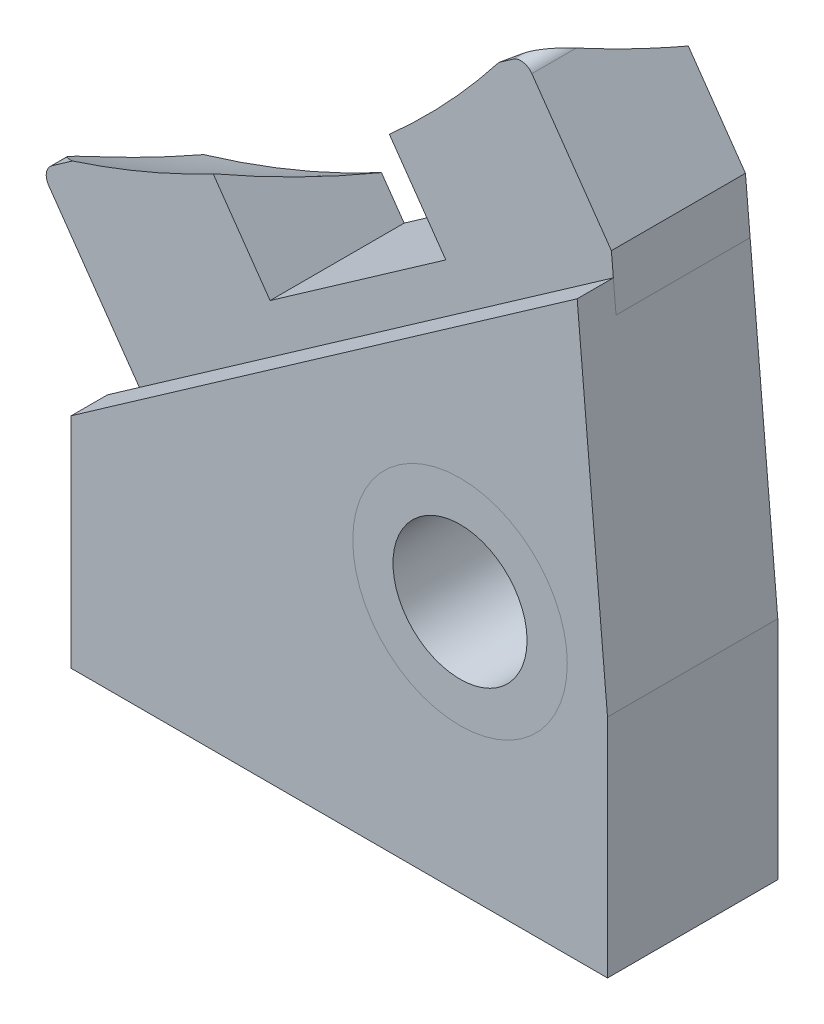
ISO-10303-21;
HEADER;
FILE_DESCRIPTION(('STEP AP214'),'2;1');
FILE_NAME('part.step','',(''),(''),'','','');
FILE_SCHEMA(('AUTOMOTIVE_DESIGN { 1 0 10303 214 1 1 1 1 }'));
ENDSEC;
DATA;
#1=APPLICATION_CONTEXT('core data for automotive mechanical design processes');
#2=APPLICATION_PROTOCOL_DEFINITION('international standard','automotive_design',2000,#1);
#3=PRODUCT_CONTEXT('',#1,'mechanical');
#4=PRODUCT('Part','Part','',(#3));
#5=PRODUCT_RELATED_PRODUCT_CATEGORY('part','',(#4));
#6=PRODUCT_DEFINITION_FORMATION('','',#4);
#7=PRODUCT_DEFINITION_CONTEXT('part definition',#1,'design');
#8=PRODUCT_DEFINITION('design','',#6,#7);
#9=PRODUCT_DEFINITION_SHAPE('','',#8);
#10=(LENGTH_UNIT() NAMED_UNIT(*) SI_UNIT(.MILLI.,.METRE.));
#11=(NAMED_UNIT(*) PLANE_ANGLE_UNIT() SI_UNIT($,.RADIAN.));
#12=(NAMED_UNIT(*) SI_UNIT($,.STERADIAN.) SOLID_ANGLE_UNIT());
#13=UNCERTAINTY_MEASURE_WITH_UNIT(LENGTH_MEASURE(1.E-05),#10,'distance_accuracy_value','');
#14=(GEOMETRIC_REPRESENTATION_CONTEXT(3) GLOBAL_UNCERTAINTY_ASSIGNED_CONTEXT((#13)) GLOBAL_UNIT_ASSIGNED_CONTEXT((#10,
#11,#12)) REPRESENTATION_CONTEXT('',''));
#15=CARTESIAN_POINT('',(0.,0.,0.));
#16=DIRECTION('',(0.,0.,1.));
#17=DIRECTION('',(1.,0.,0.));
#18=AXIS2_PLACEMENT_3D('',#15,#16,#17);
#19=CARTESIAN_POINT('',(14.5,9.4,0.));
#20=DIRECTION('',(0.,0.,1.));
#21=DIRECTION('',(1.,0.,0.));
#22=AXIS2_PLACEMENT_3D('',#19,#20,#21);
#23=CYLINDRICAL_SURFACE('',#22,4.);
#24=CARTESIAN_POINT('',(14.5,9.4,0.));
#25=DIRECTION('',(0.,0.,1.));
#26=DIRECTION('',(1.,0.,0.));
#27=AXIS2_PLACEMENT_3D('',#24,#25,#26);
#28=CIRCLE('',#27,4.);
#29=CARTESIAN_POINT('',(18.5,9.4,0.));
#30=VERTEX_POINT('',#29);
#31=EDGE_CURVE('E11',#30,#30,#28,.T.);
#32=ORIENTED_EDGE('',*,*,#31,.T.);
#33=EDGE_LOOP('',(#32));
#34=FACE_BOUND('',#33,.T.);
#35=CARTESIAN_POINT('',(14.5,9.4,6.35));
#36=DIRECTION('',(0.,0.,1.));
#37=DIRECTION('',(1.,0.,0.));
#38=AXIS2_PLACEMENT_3D('',#35,#36,#37);
#39=CIRCLE('',#38,4.);
#40=CARTESIAN_POINT('',(18.5,9.4,6.35));
#41=VERTEX_POINT('',#40);
#42=EDGE_CURVE('E47',#41,#41,#39,.T.);
#43=ORIENTED_EDGE('',*,*,#42,.F.);
#44=EDGE_LOOP('',(#43));
#45=FACE_BOUND('',#44,.T.);
#46=ADVANCED_FACE('F44',(#34,#45),#23,.T.);
#47=CARTESIAN_POINT('',(14.5,9.4,0.));
#48=DIRECTION('',(0.,0.,1.));
#49=DIRECTION('',(1.,0.,0.));
#50=AXIS2_PLACEMENT_3D('',#47,#48,#49);
#51=PLANE('',#50);
#52=CARTESIAN_POINT('',(14.5,9.4,0.));
#53=DIRECTION('',(0.,0.,1.));
#54=DIRECTION('',(1.,0.,0.));
#55=AXIS2_PLACEMENT_3D('',#52,#53,#54);
#56=CIRCLE('',#55,2.5);
#57=CARTESIAN_POINT('',(17.,9.4,0.));
#58=VERTEX_POINT('',#57);
#59=EDGE_CURVE('E54',#58,#58,#56,.T.);
#60=ORIENTED_EDGE('',*,*,#59,.T.);
#61=EDGE_LOOP('',(#60));
#62=FACE_BOUND('',#61,.T.);
#63=ORIENTED_EDGE('',*,*,#31,.F.);
#64=EDGE_LOOP('',(#63));
#65=FACE_BOUND('',#64,.T.);
#66=ADVANCED_FACE('F62',(#62,#65),#51,.F.);
#67=CARTESIAN_POINT('',(14.5,9.4,6.35));
#68=DIRECTION('',(0.,0.,1.));
#69=DIRECTION('',(1.,0.,0.));
#70=AXIS2_PLACEMENT_3D('',#67,#68,#69);
#71=PLANE('',#70);
#72=CARTESIAN_POINT('',(14.5,9.4,6.35));
#73=DIRECTION('',(0.,0.,1.));
#74=DIRECTION('',(1.,0.,0.));
#75=AXIS2_PLACEMENT_3D('',#72,#73,#74);
#76=CIRCLE('',#75,2.5);
#77=CARTESIAN_POINT('',(17.,9.4,6.35));
#78=VERTEX_POINT('',#77);
#79=EDGE_CURVE('E56',#78,#78,#76,.T.);
#80=ORIENTED_EDGE('',*,*,#79,.F.);
#81=EDGE_LOOP('',(#80));
#82=FACE_BOUND('',#81,.T.);
#83=ORIENTED_EDGE('',*,*,#42,.T.);
#84=EDGE_LOOP('',(#83));
#85=FACE_BOUND('',#84,.T.);
#86=ADVANCED_FACE('F68',(#82,#85),#71,.T.);
#87=CARTESIAN_POINT('',(14.5,9.4,0.));
#88=DIRECTION('',(0.,0.,1.));
#89=DIRECTION('',(1.,0.,0.));
#90=AXIS2_PLACEMENT_3D('',#87,#88,#89);
#91=CYLINDRICAL_SURFACE('',#90,2.5);
#92=ORIENTED_EDGE('',*,*,#59,.F.);
#93=EDGE_LOOP('',(#92));
#94=FACE_BOUND('',#93,.T.);
#95=ORIENTED_EDGE('',*,*,#79,.T.);
#96=EDGE_LOOP('',(#95));
#97=FACE_BOUND('',#96,.T.);
#98=ADVANCED_FACE('F65',(#94,#97),#91,.F.);
#99=CLOSED_SHELL('',(#46,#66,#86,#98));
#100=MANIFOLD_SOLID_BREP('B2',#99);
#101=CARTESIAN_POINT('',(1.76621588567381,8.17458828241091,0.));
#102=DIRECTION('',(-0.573576436351047,0.819152044288991,0.));
#103=DIRECTION('',(-0.819152044288991,-0.573576436351047,0.));
#104=AXIS2_PLACEMENT_3D('',#101,#102,#103);
#105=PLANE('',#104);
#106=DIRECTION('',(-0.819152044288991,-0.573576436351047,0.));
#107=VECTOR('',#106,1.);
#108=CARTESIAN_POINT('',(1.76621588567381,8.17458828241091,5.));
#109=LINE('',#108,#107);
#110=CARTESIAN_POINT('',(18.9684088157426,20.2196934457829,5.));
#111=VERTEX_POINT('',#110);
#112=CARTESIAN_POINT('',(1.76621588567381,8.17458828241091,5.));
#113=VERTEX_POINT('',#112);
#114=EDGE_CURVE('E273',#111,#113,#109,.T.);
#115=ORIENTED_EDGE('',*,*,#114,.T.);
#116=DIRECTION('',(0.,0.,1.));
#117=VECTOR('',#116,1.);
#118=CARTESIAN_POINT('',(1.76621588567381,8.17458828241091,0.));
#119=LINE('',#118,#117);
#120=CARTESIAN_POINT('',(1.76621588567381,8.17458828241091,0.));
#121=VERTEX_POINT('',#120);
#122=EDGE_CURVE('E213',#121,#113,#119,.T.);
#123=ORIENTED_EDGE('',*,*,#122,.F.);
#124=DIRECTION('',(-0.819152044288991,-0.573576436351047,0.));
#125=VECTOR('',#124,1.);
#126=CARTESIAN_POINT('',(1.76621588567381,8.17458828241091,0.));
#127=LINE('',#126,#125);
#128=CARTESIAN_POINT('',(18.9684088157426,20.2196934457829,0.));
#129=VERTEX_POINT('',#128);
#130=EDGE_CURVE('E237',#129,#121,#127,.T.);
#131=ORIENTED_EDGE('',*,*,#130,.F.);
#132=DIRECTION('',(0.,0.,1.));
#133=VECTOR('',#132,1.);
#134=CARTESIAN_POINT('',(18.9684088157426,20.2196934457829,0.));
#135=LINE('',#134,#133);
#136=EDGE_CURVE('E238',#129,#111,#135,.T.);
#137=ORIENTED_EDGE('',*,*,#136,.T.);
#138=EDGE_LOOP('',(#115,#123,#131,#137));
#139=FACE_BOUND('',#138,.T.);
#140=ADVANCED_FACE('F115',(#139),#105,.F.);
#141=CARTESIAN_POINT('',(-2.19146152514842,13.8267373880049,0.));
#142=DIRECTION('',(0.81915204428899,0.573576436351049,0.));
#143=DIRECTION('',(-0.573576436351049,0.81915204428899,0.));
#144=AXIS2_PLACEMENT_3D('',#141,#142,#143);
#145=PLANE('',#144);
#146=DIRECTION('',(0.,0.,1.));
#147=VECTOR('',#146,1.);
#148=CARTESIAN_POINT('',(-2.19146152514842,13.8267373880049,0.));
#149=LINE('',#148,#147);
#150=CARTESIAN_POINT('',(-2.19146152514842,13.8267373880049,3.14743885674291));
#151=VERTEX_POINT('',#150);
#152=CARTESIAN_POINT('',(-2.19146152514842,13.8267373880049,5.));
#153=VERTEX_POINT('',#152);
#154=EDGE_CURVE('E256',#151,#153,#149,.T.);
#155=ORIENTED_EDGE('',*,*,#154,.F.);
#156=CARTESIAN_POINT('',(-20.5747439319309,40.0807855146286,-12.575));
#157=DIRECTION('',(0.81915204428899,0.573576436351049,0.));
#158=DIRECTION('',(-0.573576436351049,0.81915204428899,0.));
#159=AXIS2_PLACEMENT_3D('',#156,#157,#158);
#160=CIRCLE('',#159,35.6989523471854);
#161=CARTESIAN_POINT('',(-1.41107043489377,12.7122234079785,0.));
#162=VERTEX_POINT('',#161);
#163=EDGE_CURVE('E281',#151,#162,#160,.T.);
#164=ORIENTED_EDGE('',*,*,#163,.T.);
#165=DIRECTION('',(-0.573576436351049,0.81915204428899,0.));
#166=VECTOR('',#165,1.);
#167=CARTESIAN_POINT('',(-2.19146152514842,13.8267373880049,0.));
#168=LINE('',#167,#166);
#169=EDGE_CURVE('E268',#121,#162,#168,.T.);
#170=ORIENTED_EDGE('',*,*,#169,.F.);
#171=ORIENTED_EDGE('',*,*,#122,.T.);
#172=DIRECTION('',(-0.573576436351049,0.81915204428899,0.));
#173=VECTOR('',#172,1.);
#174=CARTESIAN_POINT('',(-2.19146152514842,13.8267373880049,5.));
#175=LINE('',#174,#173);
#176=EDGE_CURVE('E264',#113,#153,#175,.T.);
#177=ORIENTED_EDGE('',*,*,#176,.T.);
#178=EDGE_LOOP('',(#155,#164,#170,#171,#177));
#179=FACE_BOUND('',#178,.T.);
#180=ADVANCED_FACE('F263',(#179),#145,.F.);
#181=CARTESIAN_POINT('',(-1.78188550300392,14.1135256061805,0.));
#182=DIRECTION('',(0.,0.,1.));
#183=DIRECTION('',(1.,0.,0.));
#184=AXIS2_PLACEMENT_3D('',#181,#182,#183);
#185=CYLINDRICAL_SURFACE('',#184,0.500000000000004);
#186=DIRECTION('',(0.,0.,1.));
#187=VECTOR('',#186,1.);
#188=CARTESIAN_POINT('',(-2.06867372117944,14.523101628325,0.));
#189=LINE('',#188,#187);
#190=CARTESIAN_POINT('',(-2.06867372117944,14.523101628325,4.45099817720472));
#191=VERTEX_POINT('',#190);
#192=CARTESIAN_POINT('',(-2.06867372117944,14.523101628325,5.));
#193=VERTEX_POINT('',#192);
#194=EDGE_CURVE('E254',#191,#193,#189,.T.);
#195=ORIENTED_EDGE('',*,*,#194,.F.);
#196=CARTESIAN_POINT('',(-2.00502989377036,14.5609701065037,4.48678663558968));
#197=CARTESIAN_POINT('',(-2.01672846327894,14.5551369022201,4.48235337617569));
#198=CARTESIAN_POINT('',(-2.02788071069159,14.5490025537958,4.47703776370984));
#199=CARTESIAN_POINT('',(-2.04900856626487,14.5363665900562,4.46503565451942));
#200=CARTESIAN_POINT('',(-2.05899528559048,14.5298694999821,4.45836411608942));
#201=CARTESIAN_POINT('',(-2.09129369058268,14.5072844763242,4.43378359838701));
#202=CARTESIAN_POINT('',(-2.11116745470781,14.490569114837,4.41327511997102));
#203=CARTESIAN_POINT('',(-2.14636894878509,14.456683243962,4.36871052390673));
#204=CARTESIAN_POINT('',(-2.16163721425105,14.4395096605899,4.34461354607604));
#205=CARTESIAN_POINT('',(-2.18661951146774,14.4076968255793,4.29798198369882));
#206=CARTESIAN_POINT('',(-2.19681364321337,14.3930425957066,4.27570828960097));
#207=CARTESIAN_POINT('',(-2.2150132656029,14.3639153884213,4.23015928721368));
#208=CARTESIAN_POINT('',(-2.22301673995691,14.3494425896089,4.20688307885433));
#209=CARTESIAN_POINT('',(-2.24427645296267,14.306452598763,4.13614366362497));
#210=CARTESIAN_POINT('',(-2.25483610305505,14.2782889068655,4.08765727964852));
#211=CARTESIAN_POINT('',(-2.27085631977183,14.2220897091891,3.98752700137146));
#212=CARTESIAN_POINT('',(-2.27612084574242,14.1940948734619,3.93583220813581));
#213=CARTESIAN_POINT('',(-2.28198183394443,14.1392790770529,3.83151158250489));
#214=CARTESIAN_POINT('',(-2.28257343832751,14.1124593667872,3.77888483820524));
#215=CARTESIAN_POINT('',(-2.27970739659492,14.060019683803,3.67309569820534));
#216=CARTESIAN_POINT('',(-2.27624567802049,14.0344009446411,3.61993281707883));
#217=CARTESIAN_POINT('',(-2.26560655063931,13.9844265373175,3.51338513964409));
#218=CARTESIAN_POINT('',(-2.25842898262819,13.9600709233233,3.46000033392479));
#219=CARTESIAN_POINT('',(-2.24215541447755,13.9171186273275,3.36319424965613));
#220=CARTESIAN_POINT('',(-2.23366631921648,13.8982946608966,3.31977045995281));
#221=CARTESIAN_POINT('',(-2.21430652482225,13.8616515185404,3.23316515846273));
#222=CARTESIAN_POINT('',(-2.2034420870907,13.8438298529816,3.18998331021881));
#223=CARTESIAN_POINT('',(-2.17887631794179,13.8087820805661,3.10274682686394));
#224=CARTESIAN_POINT('',(-2.16510683871342,13.791584681523,3.05869976638875));
#225=CARTESIAN_POINT('',(-2.13466902570549,13.7584902778389,2.97113689591945));
#226=CARTESIAN_POINT('',(-2.11800248560398,13.7425924774703,2.92762077493771));
#227=CARTESIAN_POINT('',(-2.09038569659118,13.7198619395452,2.86277535180127));
#228=CARTESIAN_POINT('',(-2.0806857558358,13.7124349744962,2.84111865999403));
#229=CARTESIAN_POINT('',(-2.06033634146403,13.6980495361927,2.79810342801912));
#230=CARTESIAN_POINT('',(-2.0496871416814,13.6910909288407,2.77674480391056));
#231=CARTESIAN_POINT('',(-2.02729390187541,13.6776972329481,2.734354074589));
#232=CARTESIAN_POINT('',(-2.01554693370292,13.6712636355557,2.71332302791638));
#233=CARTESIAN_POINT('',(-1.99080209229597,13.6590575783331,2.6717854778283));
#234=CARTESIAN_POINT('',(-1.97780300139244,13.6532857742779,2.65127951007535));
#235=CARTESIAN_POINT('',(-1.9640986741615,13.647909497936,2.63112584982703));
#236=B_SPLINE_CURVE_WITH_KNOTS('',3,(#196,#197,#198,#199,#200,#201,#202,#203,#204,#205,#206,
#207,#208,#209,#210,#211,#212,#213,#214,#215,#216,#217,#218,#219,#220,#221,#222,#223,#224,#225,
#226,#227,#228,#229,#230,#231,#232,#233,#234,#235),.UNSPECIFIED.,.F.,.F.,(4,2,2,2,2,2,2,2,2,2,2,
2,2,2,2,2,2,2,2,4),(0.,0.0412905066520692,0.082148076769165,0.180515417161114,0.280103251882235,
0.365609009398243,0.45119320412109,0.621929257275343,0.79877648876252,0.97580754188915,
1.15301661456704,1.33023328033844,1.47441965980284,1.61823045061032,1.765890417379,
1.91345928590351,1.98803423396507,2.0625877385045,2.13734611216348,2.21217793557636),.UNSPECIFIED.);
#237=EDGE_CURVE('E317',#191,#151,#236,.T.);
#238=ORIENTED_EDGE('',*,*,#237,.T.);
#239=ORIENTED_EDGE('',*,*,#154,.T.);
#240=CARTESIAN_POINT('',(-1.78188550300392,14.1135256061805,5.));
#241=DIRECTION('',(0.,0.,-1.));
#242=DIRECTION('',(1.,0.,0.));
#243=AXIS2_PLACEMENT_3D('',#240,#241,#242);
#244=CIRCLE('',#243,0.500000000000004);
#245=EDGE_CURVE('E278',#153,#193,#244,.T.);
#246=ORIENTED_EDGE('',*,*,#245,.T.);
#247=EDGE_LOOP('',(#195,#238,#239,#246));
#248=FACE_BOUND('',#247,.T.);
#249=ADVANCED_FACE('F326',(#248),#185,.T.);
#250=CARTESIAN_POINT('',(3.255814566699,18.2513484646068,0.));
#251=DIRECTION('',(0.573576436351047,-0.819152044288991,0.));
#252=DIRECTION('',(0.819152044288991,0.573576436351047,0.));
#253=AXIS2_PLACEMENT_3D('',#250,#251,#252);
#254=PLANE('',#253);
#255=DIRECTION('',(0.819152044288991,0.573576436351047,0.));
#256=VECTOR('',#255,1.);
#257=CARTESIAN_POINT('',(3.255814566699,18.2513484646068,5.));
#258=LINE('',#257,#256);
#259=CARTESIAN_POINT('',(-1.30382888322489,15.0586517494215,5.));
#260=VERTEX_POINT('',#259);
#261=EDGE_CURVE('E289',#193,#260,#258,.T.);
#262=ORIENTED_EDGE('',*,*,#261,.T.);
#263=CARTESIAN_POINT('',(6.64649418860697,20.6255278955208,-12.575));
#264=DIRECTION('',(0.573576436351047,-0.819152044288991,0.));
#265=DIRECTION('',(0.819152044288991,0.573576436351047,0.));
#266=AXIS2_PLACEMENT_3D('',#263,#264,#265);
#267=CIRCLE('',#266,20.076811798005);
#268=EDGE_CURVE('E128',#260,#191,#267,.T.);
#269=ORIENTED_EDGE('',*,*,#268,.T.);
#270=ORIENTED_EDGE('',*,*,#194,.T.);
#271=EDGE_LOOP('',(#262,#269,#270));
#272=FACE_BOUND('',#271,.T.);
#273=ADVANCED_FACE('F361',(#272),#254,.F.);
#274=CARTESIAN_POINT('',(3.255814566699,18.2513484646068,0.));
#275=DIRECTION('',(-0.819152044288991,-0.573576436351047,0.));
#276=DIRECTION('',(0.573576436351047,-0.819152044288991,0.));
#277=AXIS2_PLACEMENT_3D('',#274,#275,#276);
#278=PLANE('',#277);
#279=DIRECTION('',(0.573576436351047,-0.819152044288991,0.));
#280=VECTOR('',#279,1.);
#281=CARTESIAN_POINT('',(3.255814566699,18.2513484646068,0.));
#282=LINE('',#281,#280);
#283=CARTESIAN_POINT('',(5.220021155257,15.4461707403279,0.));
#284=VERTEX_POINT('',#283);
#285=CARTESIAN_POINT('',(6.06633910481913,14.2375034475907,0.));
#286=VERTEX_POINT('',#285);
#287=EDGE_CURVE('E310',#284,#286,#282,.T.);
#288=ORIENTED_EDGE('',*,*,#287,.F.);
#289=CARTESIAN_POINT('',(-14.840679621908,44.095820569086,-12.575));
#290=DIRECTION('',(-0.819152044288991,-0.573576436351047,0.));
#291=DIRECTION('',(0.573576436351047,-0.819152044288991,0.));
#292=AXIS2_PLACEMENT_3D('',#289,#290,#291);
#293=CIRCLE('',#292,37.1667159698218);
#294=CARTESIAN_POINT('',(3.94326256215231,17.2695709801612,5.));
#295=VERTEX_POINT('',#294);
#296=EDGE_CURVE('E343',#284,#295,#293,.T.);
#297=ORIENTED_EDGE('',*,*,#296,.T.);
#298=DIRECTION('',(0.573576436351047,-0.819152044288991,0.));
#299=VECTOR('',#298,1.);
#300=CARTESIAN_POINT('',(3.255814566699,18.2513484646068,5.));
#301=LINE('',#300,#299);
#302=CARTESIAN_POINT('',(6.06633910481913,14.2375034475907,5.));
#303=VERTEX_POINT('',#302);
#304=EDGE_CURVE('E292',#295,#303,#301,.T.);
#305=ORIENTED_EDGE('',*,*,#304,.T.);
#306=DIRECTION('',(0.,0.,1.));
#307=VECTOR('',#306,1.);
#308=CARTESIAN_POINT('',(6.06633910481913,14.2375034475907,0.));
#309=LINE('',#308,#307);
#310=EDGE_CURVE('E251',#286,#303,#309,.T.);
#311=ORIENTED_EDGE('',*,*,#310,.F.);
#312=EDGE_LOOP('',(#288,#297,#305,#311));
#313=FACE_BOUND('',#312,.T.);
#314=ADVANCED_FACE('F359',(#313),#278,.F.);
#315=CARTESIAN_POINT('',(6.06633910481913,14.2375034475907,0.));
#316=DIRECTION('',(0.573576436351047,-0.819152044288991,0.));
#317=DIRECTION('',(0.819152044288991,0.573576436351047,0.));
#318=AXIS2_PLACEMENT_3D('',#315,#316,#317);
#319=PLANE('',#318);
#320=DIRECTION('',(0.819152044288991,0.573576436351047,0.));
#321=VECTOR('',#320,1.);
#322=CARTESIAN_POINT('',(6.06633910481913,14.2375034475907,5.));
#323=LINE('',#322,#321);
#324=CARTESIAN_POINT('',(12.6195554591311,18.8261149383991,5.));
#325=VERTEX_POINT('',#324);
#326=EDGE_CURVE('E230',#303,#325,#323,.T.);
#327=ORIENTED_EDGE('',*,*,#326,.T.);
#328=DIRECTION('',(0.,0.,1.));
#329=VECTOR('',#328,1.);
#330=CARTESIAN_POINT('',(12.6195554591311,18.8261149383991,0.));
#331=LINE('',#330,#329);
#332=CARTESIAN_POINT('',(12.6195554591311,18.8261149383991,0.));
#333=VERTEX_POINT('',#332);
#334=EDGE_CURVE('E248',#333,#325,#331,.T.);
#335=ORIENTED_EDGE('',*,*,#334,.F.);
#336=DIRECTION('',(0.819152044288991,0.573576436351047,0.));
#337=VECTOR('',#336,1.);
#338=CARTESIAN_POINT('',(6.06633910481913,14.2375034475907,0.));
#339=LINE('',#338,#337);
#340=EDGE_CURVE('E308',#286,#333,#339,.T.);
#341=ORIENTED_EDGE('',*,*,#340,.F.);
#342=ORIENTED_EDGE('',*,*,#310,.T.);
#343=EDGE_LOOP('',(#327,#335,#341,#342));
#344=FACE_BOUND('',#343,.T.);
#345=ADVANCED_FACE('F296',(#344),#319,.F.);
#346=CARTESIAN_POINT('',(9.80903092101094,22.8399599554152,0.));
#347=DIRECTION('',(0.819152044288992,0.573576436351046,0.));
#348=DIRECTION('',(-0.573576436351046,0.819152044288992,0.));
#349=AXIS2_PLACEMENT_3D('',#346,#347,#348);
#350=PLANE('',#349);
#351=DIRECTION('',(-0.573576436351046,0.819152044288992,0.));
#352=VECTOR('',#351,1.);
#353=CARTESIAN_POINT('',(9.80903092101094,22.8399599554152,5.));
#354=LINE('',#353,#352);
#355=CARTESIAN_POINT('',(10.5159806349556,21.8303311305782,5.));
#356=VERTEX_POINT('',#355);
#357=EDGE_CURVE('E226',#325,#356,#354,.T.);
#358=ORIENTED_EDGE('',*,*,#357,.T.);
#359=CARTESIAN_POINT('',(-8.28746326759597,48.6844320598944,-12.575));
#360=DIRECTION('',(0.819152044288992,0.573576436351046,0.));
#361=DIRECTION('',(-0.573576436351046,0.819152044288992,0.));
#362=AXIS2_PLACEMENT_3D('',#359,#360,#361);
#363=CIRCLE('',#362,37.1966781355312);
#364=CARTESIAN_POINT('',(11.7914992129017,20.008701815922,0.));
#365=VERTEX_POINT('',#364);
#366=EDGE_CURVE('E136',#356,#365,#363,.T.);
#367=ORIENTED_EDGE('',*,*,#366,.T.);
#368=DIRECTION('',(-0.573576436351046,0.819152044288992,0.));
#369=VECTOR('',#368,1.);
#370=CARTESIAN_POINT('',(9.80903092101094,22.8399599554152,0.));
#371=LINE('',#370,#369);
#372=EDGE_CURVE('E304',#333,#365,#371,.T.);
#373=ORIENTED_EDGE('',*,*,#372,.F.);
#374=ORIENTED_EDGE('',*,*,#334,.T.);
#375=EDGE_LOOP('',(#358,#367,#373,#374));
#376=FACE_BOUND('',#375,.T.);
#377=ADVANCED_FACE('F302',(#376),#350,.F.);
#378=CARTESIAN_POINT('',(15.1335192088894,26.568206791697,0.));
#379=DIRECTION('',(0.573576436351047,-0.819152044288991,0.));
#380=DIRECTION('',(0.819152044288991,0.573576436351047,0.));
#381=AXIS2_PLACEMENT_3D('',#378,#379,#380);
#382=PLANE('',#381);
#383=DIRECTION('',(0.,0.,1.));
#384=VECTOR('',#383,1.);
#385=CARTESIAN_POINT('',(15.1335192088894,26.568206791697,0.));
#386=LINE('',#385,#384);
#387=CARTESIAN_POINT('',(15.1335192088894,26.568206791697,4.62189930814719));
#388=VERTEX_POINT('',#387);
#389=CARTESIAN_POINT('',(15.1335192088894,26.568206791697,5.));
#390=VERTEX_POINT('',#389);
#391=EDGE_CURVE('E220',#388,#390,#386,.T.);
#392=ORIENTED_EDGE('',*,*,#391,.F.);
#393=CARTESIAN_POINT('',(6.64649418860696,20.6255278955208,-12.575));
#394=DIRECTION('',(0.573576436351047,-0.819152044288991,0.));
#395=DIRECTION('',(0.819152044288991,0.573576436351047,0.));
#396=AXIS2_PLACEMENT_3D('',#393,#394,#395);
#397=CIRCLE('',#396,20.076811798005);
#398=CARTESIAN_POINT('',(14.5968172604388,26.19240404162,5.));
#399=VERTEX_POINT('',#398);
#400=EDGE_CURVE('E207',#388,#399,#397,.T.);
#401=ORIENTED_EDGE('',*,*,#400,.T.);
#402=DIRECTION('',(0.819152044288991,0.573576436351047,0.));
#403=VECTOR('',#402,1.);
#404=CARTESIAN_POINT('',(15.1335192088894,26.568206791697,5.));
#405=LINE('',#404,#403);
#406=EDGE_CURVE('E218',#399,#390,#405,.T.);
#407=ORIENTED_EDGE('',*,*,#406,.T.);
#408=EDGE_LOOP('',(#392,#401,#407));
#409=FACE_BOUND('',#408,.T.);
#410=ADVANCED_FACE('F217',(#409),#382,.F.);
#411=CARTESIAN_POINT('',(15.4203074270649,26.1586307695525,0.));
#412=DIRECTION('',(0.,0.,1.));
#413=DIRECTION('',(1.,0.,0.));
#414=AXIS2_PLACEMENT_3D('',#411,#412,#413);
#415=CYLINDRICAL_SURFACE('',#414,0.500000000000004);
#416=DIRECTION('',(0.,0.,1.));
#417=VECTOR('',#416,1.);
#418=CARTESIAN_POINT('',(15.8298834492094,26.445418987728,0.));
#419=LINE('',#418,#417);
#420=CARTESIAN_POINT('',(15.8298834492094,26.445418987728,3.34110274314999));
#421=VERTEX_POINT('',#420);
#422=CARTESIAN_POINT('',(15.8298834492094,26.445418987728,5.));
#423=VERTEX_POINT('',#422);
#424=EDGE_CURVE('E245',#421,#423,#419,.T.);
#425=ORIENTED_EDGE('',*,*,#424,.F.);
#426=CARTESIAN_POINT('',(15.8300234179695,26.445218987728,3.34061120333065));
#427=CARTESIAN_POINT('',(15.820737310627,26.458485317027,3.37321945634485));
#428=CARTESIAN_POINT('',(15.8109101295611,26.471172431617,3.4059014664241));
#429=CARTESIAN_POINT('',(15.7902202544462,26.4954088507666,3.47135929527277));
#430=CARTESIAN_POINT('',(15.7793575748163,26.5069581711651,3.50413511272979));
#431=CARTESIAN_POINT('',(15.7452085963353,26.540005637695,3.60274710363396));
#432=CARTESIAN_POINT('',(15.7204251126557,26.5598133354765,3.66864535713327));
#433=CARTESIAN_POINT('',(15.666750715416,26.5948675653505,3.80073192558767));
#434=CARTESIAN_POINT('',(15.6378238018157,26.6100700404976,3.86691725280711));
#435=CARTESIAN_POINT('',(15.5759124707009,26.6349740133313,3.99833479984366));
#436=CARTESIAN_POINT('',(15.5429353783005,26.6446852691284,4.06356850840494));
#437=CARTESIAN_POINT('',(15.4836375117419,26.65520142319,4.17175083140276));
#438=CARTESIAN_POINT('',(15.4585365810198,26.6578568407398,4.21518702821803));
#439=CARTESIAN_POINT('',(15.4059008479247,26.6591209035427,4.30073378596808));
#440=CARTESIAN_POINT('',(15.3783645012612,26.6577269630118,4.3428434824906));
#441=CARTESIAN_POINT('',(15.3286664974992,26.6506069851645,4.41306044304535));
#442=CARTESIAN_POINT('',(15.3071760418763,26.6462119698995,4.44177047864069));
#443=CARTESIAN_POINT('',(15.2627063398303,26.6337041881675,4.49697072474863));
#444=CARTESIAN_POINT('',(15.2397372475824,26.6256148502799,4.52347369801733));
#445=CARTESIAN_POINT('',(15.2026921751986,26.6090243756713,4.56192682204405));
#446=CARTESIAN_POINT('',(15.1891651013015,26.6022805317895,4.57513755673285));
#447=CARTESIAN_POINT('',(15.1615880876323,26.5867811584544,4.59997041611349));
#448=CARTESIAN_POINT('',(15.1475347412782,26.578009405029,4.61157845328144));
#449=CARTESIAN_POINT('',(15.1333192088894,26.5680666773921,4.62204631937596));
#450=B_SPLINE_CURVE_WITH_KNOTS('',3,(#426,#427,#428,#429,#430,#431,#432,#433,#434,#435,#436,
#437,#438,#439,#440,#441,#442,#443,#444,#445,#446,#447,#448,#449),.UNSPECIFIED.,.F.,.F.,(4,2,2,
2,2,2,2,2,2,2,2,4),(0.,0.109201888111957,0.218402255842343,0.437545561198591,0.658723562172715,
0.879507275953485,1.03005437128678,1.18069762207095,1.28890306804247,1.39643162898834,
1.45650495506648,1.51707662303462),.UNSPECIFIED.);
#451=EDGE_CURVE('E337',#421,#388,#450,.T.);
#452=ORIENTED_EDGE('',*,*,#451,.T.);
#453=ORIENTED_EDGE('',*,*,#391,.T.);
#454=CARTESIAN_POINT('',(15.4203074270649,26.1586307695525,5.));
#455=DIRECTION('',(0.,0.,-1.));
#456=DIRECTION('',(1.,0.,0.));
#457=AXIS2_PLACEMENT_3D('',#454,#455,#456);
#458=CIRCLE('',#457,0.500000000000004);
#459=EDGE_CURVE('E225',#390,#423,#458,.T.);
#460=ORIENTED_EDGE('',*,*,#459,.T.);
#461=EDGE_LOOP('',(#425,#452,#453,#460));
#462=FACE_BOUND('',#461,.T.);
#463=ADVANCED_FACE('F345',(#462),#415,.T.);
#464=CARTESIAN_POINT('',(18.7940973302473,22.2120828419664,0.));
#465=DIRECTION('',(-0.819152044288992,-0.573576436351046,0.));
#466=DIRECTION('',(0.573576436351046,-0.819152044288992,0.));
#467=AXIS2_PLACEMENT_3D('',#464,#465,#466);
#468=PLANE('',#467);
#469=DIRECTION('',(0.573576436351046,-0.819152044288992,0.));
#470=VECTOR('',#469,1.);
#471=CARTESIAN_POINT('',(18.7940973302473,22.2120828419664,0.));
#472=LINE('',#471,#470);
#473=CARTESIAN_POINT('',(16.6627968967664,25.2558953078108,0.));
#474=VERTEX_POINT('',#473);
#475=CARTESIAN_POINT('',(18.7940973302473,22.2120828419664,0.));
#476=VERTEX_POINT('',#475);
#477=EDGE_CURVE('E307',#474,#476,#472,.T.);
#478=ORIENTED_EDGE('',*,*,#477,.F.);
#479=CARTESIAN_POINT('',(-2.55339895757303,52.6994671143517,-12.575));
#480=DIRECTION('',(-0.819152044288992,-0.573576436351046,0.));
#481=DIRECTION('',(0.573576436351046,-0.819152044288992,0.));
#482=AXIS2_PLACEMENT_3D('',#479,#480,#481);
#483=CIRCLE('',#482,35.7846676890131);
#484=EDGE_CURVE('E344',#474,#421,#483,.T.);
#485=ORIENTED_EDGE('',*,*,#484,.T.);
#486=ORIENTED_EDGE('',*,*,#424,.T.);
#487=DIRECTION('',(0.573576436351046,-0.819152044288992,0.));
#488=VECTOR('',#487,1.);
#489=CARTESIAN_POINT('',(18.7940973302473,22.2120828419664,5.));
#490=LINE('',#489,#488);
#491=CARTESIAN_POINT('',(18.7940973302473,22.2120828419664,5.));
#492=VERTEX_POINT('',#491);
#493=EDGE_CURVE('E228',#423,#492,#490,.T.);
#494=ORIENTED_EDGE('',*,*,#493,.T.);
#495=DIRECTION('',(0.,0.,1.));
#496=VECTOR('',#495,1.);
#497=CARTESIAN_POINT('',(18.7940973302473,22.2120828419664,0.));
#498=LINE('',#497,#496);
#499=EDGE_CURVE('E241',#476,#492,#498,.T.);
#500=ORIENTED_EDGE('',*,*,#499,.F.);
#501=EDGE_LOOP('',(#478,#485,#486,#494,#500));
#502=FACE_BOUND('',#501,.T.);
#503=ADVANCED_FACE('F350',(#502),#468,.F.);
#504=CARTESIAN_POINT('',(18.7940973302473,22.2120828419664,0.));
#505=DIRECTION('',(-0.996194698091747,-0.0871557427476483,0.));
#506=DIRECTION('',(0.0871557427476483,-0.996194698091747,0.));
#507=AXIS2_PLACEMENT_3D('',#504,#505,#506);
#508=PLANE('',#507);
#509=DIRECTION('',(0.0871557427476483,-0.996194698091747,0.));
#510=VECTOR('',#509,1.);
#511=CARTESIAN_POINT('',(18.7940973302473,22.2120828419664,5.));
#512=LINE('',#511,#510);
#513=EDGE_CURVE('E235',#492,#111,#512,.T.);
#514=ORIENTED_EDGE('',*,*,#513,.T.);
#515=ORIENTED_EDGE('',*,*,#136,.F.);
#516=DIRECTION('',(0.0871557427476483,-0.996194698091747,0.));
#517=VECTOR('',#516,1.);
#518=CARTESIAN_POINT('',(18.7940973302473,22.2120828419664,0.));
#519=LINE('',#518,#517);
#520=EDGE_CURVE('E242',#476,#129,#519,.T.);
#521=ORIENTED_EDGE('',*,*,#520,.F.);
#522=ORIENTED_EDGE('',*,*,#499,.T.);
#523=EDGE_LOOP('',(#514,#515,#521,#522));
#524=FACE_BOUND('',#523,.T.);
#525=ADVANCED_FACE('F418',(#524),#508,.F.);
#526=CARTESIAN_POINT('',(15.4203074270649,26.1586307695525,0.));
#527=DIRECTION('',(0.,0.,1.));
#528=DIRECTION('',(1.,0.,0.));
#529=AXIS2_PLACEMENT_3D('',#526,#527,#528);
#530=PLANE('',#529);
#531=ORIENTED_EDGE('',*,*,#169,.T.);
#532=CARTESIAN_POINT('',(-11.45,46.47,0.));
#533=DIRECTION('',(0.,0.,1.));
#534=DIRECTION('',(1.,0.,0.));
#535=AXIS2_PLACEMENT_3D('',#532,#533,#534);
#536=CIRCLE('',#535,35.2188527247837);
#537=EDGE_CURVE('E276',#162,#284,#536,.T.);
#538=ORIENTED_EDGE('',*,*,#537,.T.);
#539=ORIENTED_EDGE('',*,*,#287,.T.);
#540=ORIENTED_EDGE('',*,*,#340,.T.);
#541=ORIENTED_EDGE('',*,*,#372,.T.);
#542=EDGE_CURVE('E283',#365,#474,#536,.T.);
#543=ORIENTED_EDGE('',*,*,#542,.T.);
#544=ORIENTED_EDGE('',*,*,#477,.T.);
#545=ORIENTED_EDGE('',*,*,#520,.T.);
#546=ORIENTED_EDGE('',*,*,#130,.T.);
#547=EDGE_LOOP('',(#531,#538,#539,#540,#541,#543,#544,#545,#546));
#548=FACE_BOUND('',#547,.T.);
#549=ADVANCED_FACE('F333',(#548),#530,.F.);
#550=CARTESIAN_POINT('',(15.4203074270649,26.1586307695525,5.));
#551=DIRECTION('',(0.,0.,1.));
#552=DIRECTION('',(1.,0.,0.));
#553=AXIS2_PLACEMENT_3D('',#550,#551,#552);
#554=PLANE('',#553);
#555=CARTESIAN_POINT('',(-11.45,46.47,5.));
#556=DIRECTION('',(0.,0.,1.));
#557=DIRECTION('',(1.,0.,0.));
#558=AXIS2_PLACEMENT_3D('',#555,#556,#557);
#559=CIRCLE('',#558,33.0093560562759);
#560=EDGE_CURVE('E42',#260,#295,#559,.T.);
#561=ORIENTED_EDGE('',*,*,#560,.F.);
#562=ORIENTED_EDGE('',*,*,#261,.F.);
#563=ORIENTED_EDGE('',*,*,#245,.F.);
#564=ORIENTED_EDGE('',*,*,#176,.F.);
#565=ORIENTED_EDGE('',*,*,#114,.F.);
#566=ORIENTED_EDGE('',*,*,#513,.F.);
#567=ORIENTED_EDGE('',*,*,#493,.F.);
#568=ORIENTED_EDGE('',*,*,#459,.F.);
#569=ORIENTED_EDGE('',*,*,#406,.F.);
#570=EDGE_CURVE('E118',#356,#399,#559,.T.);
#571=ORIENTED_EDGE('',*,*,#570,.F.);
#572=ORIENTED_EDGE('',*,*,#357,.F.);
#573=ORIENTED_EDGE('',*,*,#326,.F.);
#574=ORIENTED_EDGE('',*,*,#304,.F.);
#575=EDGE_LOOP('',(#561,#562,#563,#564,#565,#566,#567,#568,#569,#571,#572,#573,#574));
#576=FACE_BOUND('',#575,.T.);
#577=ADVANCED_FACE('F222',(#576),#554,.T.);
#578=CARTESIAN_POINT('',(-11.45,46.47,-12.575));
#579=DIRECTION('',(-1.,0.,0.));
#580=DIRECTION('',(0.,1.,0.));
#581=AXIS2_PLACEMENT_3D('',#578,#579,#580);
#582=SPHERICAL_SURFACE('',#581,37.3965);
#583=ORIENTED_EDGE('',*,*,#484,.F.);
#584=ORIENTED_EDGE('',*,*,#542,.F.);
#585=ORIENTED_EDGE('',*,*,#366,.F.);
#586=ORIENTED_EDGE('',*,*,#570,.T.);
#587=ORIENTED_EDGE('',*,*,#400,.F.);
#588=ORIENTED_EDGE('',*,*,#451,.F.);
#589=EDGE_LOOP('',(#583,#584,#585,#586,#587,#588));
#590=FACE_BOUND('',#589,.T.);
#591=ADVANCED_FACE('F206',(#590),#582,.F.);
#592=ORIENTED_EDGE('',*,*,#163,.F.);
#593=ORIENTED_EDGE('',*,*,#237,.F.);
#594=ORIENTED_EDGE('',*,*,#268,.F.);
#595=ORIENTED_EDGE('',*,*,#560,.T.);
#596=ORIENTED_EDGE('',*,*,#296,.F.);
#597=ORIENTED_EDGE('',*,*,#537,.F.);
#598=EDGE_LOOP('',(#592,#593,#594,#595,#596,#597));
#599=FACE_BOUND('',#598,.T.);
#600=ADVANCED_FACE('F329',(#599),#582,.F.);
#601=CLOSED_SHELL('',(#140,#180,#249,#273,#314,#345,#377,#410,#463,#503,#525,#549,#577,#591,#600));
#602=MANIFOLD_SOLID_BREP('B6',#601);
#603=CARTESIAN_POINT('',(0.,0.,0.));
#604=DIRECTION('',(0.,0.,-1.));
#605=DIRECTION('',(-1.,0.,0.));
#606=AXIS2_PLACEMENT_3D('',#603,#604,#605);
#607=PLANE('',#606);
#608=CARTESIAN_POINT('',(14.5,9.4,0.));
#609=DIRECTION('',(0.,0.,1.));
#610=DIRECTION('',(1.,0.,0.));
#611=AXIS2_PLACEMENT_3D('',#608,#609,#610);
#612=CIRCLE('',#611,4.);
#613=CARTESIAN_POINT('',(18.5,9.4,0.));
#614=VERTEX_POINT('',#613);
#615=EDGE_CURVE('E597',#614,#614,#612,.T.);
#616=ORIENTED_EDGE('',*,*,#615,.T.);
#617=EDGE_LOOP('',(#616));
#618=FACE_BOUND('',#617,.T.);
#619=DIRECTION('',(0.,-1.,0.));
#620=VECTOR('',#619,1.);
#621=CARTESIAN_POINT('',(0.,8.15864519391782,0.));
#622=LINE('',#621,#620);
#623=CARTESIAN_POINT('',(0.,6.93787060515636,0.));
#624=VERTEX_POINT('',#623);
#625=CARTESIAN_POINT('',(0.,0.,0.));
#626=VERTEX_POINT('',#625);
#627=EDGE_CURVE('E559',#624,#626,#622,.T.);
#628=ORIENTED_EDGE('',*,*,#627,.F.);
#629=DIRECTION('',(-0.819152044288991,-0.573576436351047,0.));
#630=VECTOR('',#629,1.);
#631=CARTESIAN_POINT('',(-3.25973290581645,4.65538105195343,0.));
#632=LINE('',#631,#630);
#633=CARTESIAN_POINT('',(18.9684088157426,20.2196934457829,0.));
#634=VERTEX_POINT('',#633);
#635=EDGE_CURVE('E579',#634,#624,#632,.T.);
#636=ORIENTED_EDGE('',*,*,#635,.F.);
#637=DIRECTION('',(-0.0871557427476517,0.996194698091746,0.));
#638=VECTOR('',#637,1.);
#639=CARTESIAN_POINT('',(20.,8.42855225465271,0.));
#640=LINE('',#639,#638);
#641=CARTESIAN_POINT('',(20.,8.42855225465271,0.));
#642=VERTEX_POINT('',#641);
#643=EDGE_CURVE('E564',#642,#634,#640,.T.);
#644=ORIENTED_EDGE('',*,*,#643,.F.);
#645=DIRECTION('',(0.,1.,0.));
#646=VECTOR('',#645,1.);
#647=CARTESIAN_POINT('',(20.,8.42855225465271,0.));
#648=LINE('',#647,#646);
#649=CARTESIAN_POINT('',(20.,0.,0.));
#650=VERTEX_POINT('',#649);
#651=EDGE_CURVE('E522',#650,#642,#648,.T.);
#652=ORIENTED_EDGE('',*,*,#651,.F.);
#653=DIRECTION('',(1.,0.,0.));
#654=VECTOR('',#653,1.);
#655=CARTESIAN_POINT('',(20.,0.,0.));
#656=LINE('',#655,#654);
#657=EDGE_CURVE('E549',#626,#650,#656,.T.);
#658=ORIENTED_EDGE('',*,*,#657,.F.);
#659=EDGE_LOOP('',(#628,#636,#644,#652,#658));
#660=FACE_BOUND('',#659,.T.);
#661=ADVANCED_FACE('F479',(#618,#660),#607,.T.);
#662=CARTESIAN_POINT('',(0.,0.,6.35));
#663=DIRECTION('',(0.,0.,-1.));
#664=DIRECTION('',(-1.,0.,0.));
#665=AXIS2_PLACEMENT_3D('',#662,#663,#664);
#666=PLANE('',#665);
#667=DIRECTION('',(-0.819152044288991,-0.573576436351047,0.));
#668=VECTOR('',#667,1.);
#669=CARTESIAN_POINT('',(18.8677700326691,21.37,6.35));
#670=LINE('',#669,#668);
#671=CARTESIAN_POINT('',(18.8677700326691,21.37,6.35));
#672=VERTEX_POINT('',#671);
#673=CARTESIAN_POINT('',(0.,8.15864519391782,6.35));
#674=VERTEX_POINT('',#673);
#675=EDGE_CURVE('E567',#672,#674,#670,.T.);
#676=ORIENTED_EDGE('',*,*,#675,.T.);
#677=DIRECTION('',(0.,-1.,0.));
#678=VECTOR('',#677,1.);
#679=CARTESIAN_POINT('',(0.,8.15864519391782,6.35));
#680=LINE('',#679,#678);
#681=CARTESIAN_POINT('',(0.,0.,6.35));
#682=VERTEX_POINT('',#681);
#683=EDGE_CURVE('E531',#674,#682,#680,.T.);
#684=ORIENTED_EDGE('',*,*,#683,.T.);
#685=DIRECTION('',(1.,0.,0.));
#686=VECTOR('',#685,1.);
#687=CARTESIAN_POINT('',(20.,0.,6.35));
#688=LINE('',#687,#686);
#689=CARTESIAN_POINT('',(20.,0.,6.35));
#690=VERTEX_POINT('',#689);
#691=EDGE_CURVE('E537',#682,#690,#688,.T.);
#692=ORIENTED_EDGE('',*,*,#691,.T.);
#693=DIRECTION('',(0.,1.,0.));
#694=VECTOR('',#693,1.);
#695=CARTESIAN_POINT('',(20.,8.42855225465271,6.35));
#696=LINE('',#695,#694);
#697=CARTESIAN_POINT('',(20.,8.42855225465271,6.35));
#698=VERTEX_POINT('',#697);
#699=EDGE_CURVE('E542',#690,#698,#696,.T.);
#700=ORIENTED_EDGE('',*,*,#699,.T.);
#701=DIRECTION('',(-0.0871557427476517,0.996194698091746,0.));
#702=VECTOR('',#701,1.);
#703=CARTESIAN_POINT('',(20.,8.42855225465271,6.35));
#704=LINE('',#703,#702);
#705=EDGE_CURVE('E503',#698,#672,#704,.T.);
#706=ORIENTED_EDGE('',*,*,#705,.T.);
#707=EDGE_LOOP('',(#676,#684,#692,#700,#706));
#708=FACE_BOUND('',#707,.T.);
#709=CARTESIAN_POINT('',(14.5,9.4,6.35));
#710=DIRECTION('',(0.,0.,1.));
#711=DIRECTION('',(1.,0.,0.));
#712=AXIS2_PLACEMENT_3D('',#709,#710,#711);
#713=CIRCLE('',#712,4.);
#714=CARTESIAN_POINT('',(18.5,9.4,6.35));
#715=VERTEX_POINT('',#714);
#716=EDGE_CURVE('E561',#715,#715,#713,.T.);
#717=ORIENTED_EDGE('',*,*,#716,.F.);
#718=EDGE_LOOP('',(#717));
#719=FACE_BOUND('',#718,.T.);
#720=ADVANCED_FACE('F539',(#708,#719),#666,.F.);
#721=CARTESIAN_POINT('',(18.8677700326691,21.37,6.35));
#722=DIRECTION('',(0.573576436351047,-0.819152044288991,0.));
#723=DIRECTION('',(0.819152044288991,0.573576436351047,0.));
#724=AXIS2_PLACEMENT_3D('',#721,#722,#723);
#725=PLANE('',#724);
#726=DIRECTION('',(0.,0.,-1.));
#727=VECTOR('',#726,1.);
#728=CARTESIAN_POINT('',(18.8677700326691,21.37,6.35));
#729=LINE('',#728,#727);
#730=CARTESIAN_POINT('',(18.8677700326691,21.37,5.));
#731=VERTEX_POINT('',#730);
#732=EDGE_CURVE('E555',#672,#731,#729,.T.);
#733=ORIENTED_EDGE('',*,*,#732,.T.);
#734=DIRECTION('',(0.819152044288991,0.573576436351047,0.));
#735=VECTOR('',#734,1.);
#736=CARTESIAN_POINT('',(-3.8333093421675,5.47453309624242,5.));
#737=LINE('',#736,#735);
#738=CARTESIAN_POINT('',(0.,8.15864519391782,5.));
#739=VERTEX_POINT('',#738);
#740=EDGE_CURVE('E606',#739,#731,#737,.T.);
#741=ORIENTED_EDGE('',*,*,#740,.F.);
#742=DIRECTION('',(0.,0.,-1.));
#743=VECTOR('',#742,1.);
#744=CARTESIAN_POINT('',(0.,8.15864519391782,6.35));
#745=LINE('',#744,#743);
#746=EDGE_CURVE('E572',#674,#739,#745,.T.);
#747=ORIENTED_EDGE('',*,*,#746,.F.);
#748=ORIENTED_EDGE('',*,*,#675,.F.);
#749=EDGE_LOOP('',(#733,#741,#747,#748));
#750=FACE_BOUND('',#749,.T.);
#751=ADVANCED_FACE('F481',(#750),#725,.F.);
#752=CARTESIAN_POINT('',(0.,8.15864519391782,6.35));
#753=DIRECTION('',(1.,0.,0.));
#754=DIRECTION('',(0.,1.,0.));
#755=AXIS2_PLACEMENT_3D('',#752,#753,#754);
#756=PLANE('',#755);
#757=ORIENTED_EDGE('',*,*,#746,.T.);
#758=DIRECTION('',(0.,-1.,0.));
#759=VECTOR('',#758,1.);
#760=CARTESIAN_POINT('',(0.,8.15864519391782,5.));
#761=LINE('',#760,#759);
#762=CARTESIAN_POINT('',(0.,6.93787060515636,5.));
#763=VERTEX_POINT('',#762);
#764=EDGE_CURVE('E600',#739,#763,#761,.T.);
#765=ORIENTED_EDGE('',*,*,#764,.T.);
#766=DIRECTION('',(0.,0.,1.));
#767=VECTOR('',#766,1.);
#768=CARTESIAN_POINT('',(0.,6.93787060515636,6.35));
#769=LINE('',#768,#767);
#770=EDGE_CURVE('E587',#624,#763,#769,.T.);
#771=ORIENTED_EDGE('',*,*,#770,.F.);
#772=ORIENTED_EDGE('',*,*,#627,.T.);
#773=DIRECTION('',(0.,0.,-1.));
#774=VECTOR('',#773,1.);
#775=CARTESIAN_POINT('',(0.,0.,6.35));
#776=LINE('',#775,#774);
#777=EDGE_CURVE('E550',#682,#626,#776,.T.);
#778=ORIENTED_EDGE('',*,*,#777,.F.);
#779=ORIENTED_EDGE('',*,*,#683,.F.);
#780=EDGE_LOOP('',(#757,#765,#771,#772,#778,#779));
#781=FACE_BOUND('',#780,.T.);
#782=ADVANCED_FACE('F614',(#781),#756,.F.);
#783=CARTESIAN_POINT('',(20.,0.,6.35));
#784=DIRECTION('',(0.,1.,0.));
#785=DIRECTION('',(-1.,0.,0.));
#786=AXIS2_PLACEMENT_3D('',#783,#784,#785);
#787=PLANE('',#786);
#788=ORIENTED_EDGE('',*,*,#657,.T.);
#789=DIRECTION('',(0.,0.,-1.));
#790=VECTOR('',#789,1.);
#791=CARTESIAN_POINT('',(20.,0.,6.35));
#792=LINE('',#791,#790);
#793=EDGE_CURVE('E546',#690,#650,#792,.T.);
#794=ORIENTED_EDGE('',*,*,#793,.F.);
#795=ORIENTED_EDGE('',*,*,#691,.F.);
#796=ORIENTED_EDGE('',*,*,#777,.T.);
#797=EDGE_LOOP('',(#788,#794,#795,#796));
#798=FACE_BOUND('',#797,.T.);
#799=ADVANCED_FACE('F547',(#798),#787,.F.);
#800=CARTESIAN_POINT('',(20.,8.42855225465271,6.35));
#801=DIRECTION('',(-1.,0.,0.));
#802=DIRECTION('',(0.,0.,1.));
#803=AXIS2_PLACEMENT_3D('',#800,#801,#802);
#804=PLANE('',#803);
#805=ORIENTED_EDGE('',*,*,#651,.T.);
#806=DIRECTION('',(0.,0.,-1.));
#807=VECTOR('',#806,1.);
#808=CARTESIAN_POINT('',(20.,8.42855225465271,6.35));
#809=LINE('',#808,#807);
#810=EDGE_CURVE('E551',#698,#642,#809,.T.);
#811=ORIENTED_EDGE('',*,*,#810,.F.);
#812=ORIENTED_EDGE('',*,*,#699,.F.);
#813=ORIENTED_EDGE('',*,*,#793,.T.);
#814=EDGE_LOOP('',(#805,#811,#812,#813));
#815=FACE_BOUND('',#814,.T.);
#816=ADVANCED_FACE('F553',(#815),#804,.F.);
#817=CARTESIAN_POINT('',(20.,8.42855225465271,6.35));
#818=DIRECTION('',(-0.996194698091746,-0.0871557427476517,0.));
#819=DIRECTION('',(0.0871557427476517,-0.996194698091746,0.));
#820=AXIS2_PLACEMENT_3D('',#817,#818,#819);
#821=PLANE('',#820);
#822=DIRECTION('',(0.,0.,-1.));
#823=VECTOR('',#822,1.);
#824=CARTESIAN_POINT('',(18.9684088157426,20.2196934457829,6.35));
#825=LINE('',#824,#823);
#826=CARTESIAN_POINT('',(18.9684088157426,20.2196934457829,5.));
#827=VERTEX_POINT('',#826);
#828=EDGE_CURVE('E487',#827,#634,#825,.T.);
#829=ORIENTED_EDGE('',*,*,#828,.F.);
#830=DIRECTION('',(-0.0871557427476517,0.996194698091746,0.));
#831=VECTOR('',#830,1.);
#832=CARTESIAN_POINT('',(20.,8.42855225465271,5.));
#833=LINE('',#832,#831);
#834=EDGE_CURVE('E113',#827,#731,#833,.T.);
#835=ORIENTED_EDGE('',*,*,#834,.T.);
#836=ORIENTED_EDGE('',*,*,#732,.F.);
#837=ORIENTED_EDGE('',*,*,#705,.F.);
#838=ORIENTED_EDGE('',*,*,#810,.T.);
#839=ORIENTED_EDGE('',*,*,#643,.T.);
#840=EDGE_LOOP('',(#829,#835,#836,#837,#838,#839));
#841=FACE_BOUND('',#840,.T.);
#842=ADVANCED_FACE('F589',(#841),#821,.F.);
#843=CARTESIAN_POINT('',(14.5,9.4,6.35));
#844=DIRECTION('',(0.,0.,-1.));
#845=DIRECTION('',(-1.,0.,0.));
#846=AXIS2_PLACEMENT_3D('',#843,#844,#845);
#847=CYLINDRICAL_SURFACE('',#846,4.);
#848=ORIENTED_EDGE('',*,*,#716,.T.);
#849=EDGE_LOOP('',(#848));
#850=FACE_BOUND('',#849,.T.);
#851=ORIENTED_EDGE('',*,*,#615,.F.);
#852=EDGE_LOOP('',(#851));
#853=FACE_BOUND('',#852,.T.);
#854=ADVANCED_FACE('F632',(#850,#853),#847,.F.);
#855=CARTESIAN_POINT('',(-3.25973290581645,4.65538105195343,5.));
#856=DIRECTION('',(0.,0.,1.));
#857=DIRECTION('',(1.,0.,0.));
#858=AXIS2_PLACEMENT_3D('',#855,#856,#857);
#859=PLANE('',#858);
#860=ORIENTED_EDGE('',*,*,#740,.T.);
#861=ORIENTED_EDGE('',*,*,#834,.F.);
#862=DIRECTION('',(0.819152044288991,0.573576436351047,0.));
#863=VECTOR('',#862,1.);
#864=CARTESIAN_POINT('',(-3.25973290581645,4.65538105195343,5.));
#865=LINE('',#864,#863);
#866=EDGE_CURVE('E494',#763,#827,#865,.T.);
#867=ORIENTED_EDGE('',*,*,#866,.F.);
#868=ORIENTED_EDGE('',*,*,#764,.F.);
#869=EDGE_LOOP('',(#860,#861,#867,#868));
#870=FACE_BOUND('',#869,.T.);
#871=ADVANCED_FACE('F611',(#870),#859,.F.);
#872=CARTESIAN_POINT('',(-3.25973290581645,4.65538105195343,0.));
#873=DIRECTION('',(-0.573576436351047,0.819152044288991,0.));
#874=DIRECTION('',(-0.819152044288991,-0.573576436351047,0.));
#875=AXIS2_PLACEMENT_3D('',#872,#873,#874);
#876=PLANE('',#875);
#877=ORIENTED_EDGE('',*,*,#770,.T.);
#878=ORIENTED_EDGE('',*,*,#866,.T.);
#879=ORIENTED_EDGE('',*,*,#828,.T.);
#880=ORIENTED_EDGE('',*,*,#635,.T.);
#881=EDGE_LOOP('',(#877,#878,#879,#880));
#882=FACE_BOUND('',#881,.T.);
#883=ADVANCED_FACE('F577',(#882),#876,.T.);
#884=CLOSED_SHELL('',(#661,#720,#751,#782,#799,#816,#842,#854,#871,#883));
#885=MANIFOLD_SOLID_BREP('B36',#884);
#886=ADVANCED_BREP_SHAPE_REPRESENTATION('',(#18,#100,#602,#885),#14);
#887=SHAPE_DEFINITION_REPRESENTATION(#9,#886);
ENDSEC;
END-ISO-10303-21;
